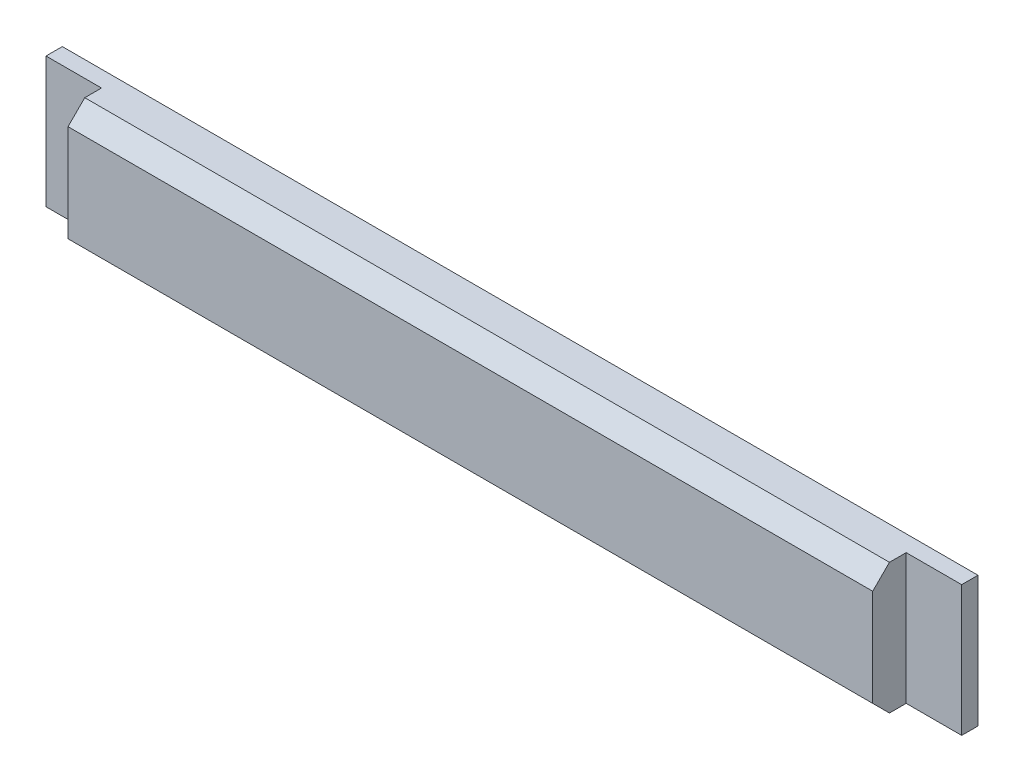
ISO-10303-21;
HEADER;
FILE_DESCRIPTION(('STEP AP214'),'2;1');
FILE_NAME('part.step','',(''),(''),'','','');
FILE_SCHEMA(('AUTOMOTIVE_DESIGN { 1 0 10303 214 1 1 1 1 }'));
ENDSEC;
DATA;
#1=APPLICATION_CONTEXT('core data for automotive mechanical design processes');
#2=APPLICATION_PROTOCOL_DEFINITION('international standard','automotive_design',2000,#1);
#3=PRODUCT_CONTEXT('',#1,'mechanical');
#4=PRODUCT('Part','Part','',(#3));
#5=PRODUCT_RELATED_PRODUCT_CATEGORY('part','',(#4));
#6=PRODUCT_DEFINITION_FORMATION('','',#4);
#7=PRODUCT_DEFINITION_CONTEXT('part definition',#1,'design');
#8=PRODUCT_DEFINITION('design','',#6,#7);
#9=PRODUCT_DEFINITION_SHAPE('','',#8);
#10=(LENGTH_UNIT() NAMED_UNIT(*) SI_UNIT(.MILLI.,.METRE.));
#11=(NAMED_UNIT(*) PLANE_ANGLE_UNIT() SI_UNIT($,.RADIAN.));
#12=(NAMED_UNIT(*) SI_UNIT($,.STERADIAN.) SOLID_ANGLE_UNIT());
#13=UNCERTAINTY_MEASURE_WITH_UNIT(LENGTH_MEASURE(1.E-05),#10,'distance_accuracy_value','');
#14=(GEOMETRIC_REPRESENTATION_CONTEXT(3) GLOBAL_UNCERTAINTY_ASSIGNED_CONTEXT((#13)) GLOBAL_UNIT_ASSIGNED_CONTEXT((#10,
#11,#12)) REPRESENTATION_CONTEXT('',''));
#15=CARTESIAN_POINT('',(0.,0.,0.));
#16=DIRECTION('',(0.,0.,1.));
#17=DIRECTION('',(1.,0.,0.));
#18=AXIS2_PLACEMENT_3D('',#15,#16,#17);
#19=CARTESIAN_POINT('',(0.,0.,5.));
#20=DIRECTION('',(0.,0.,1.));
#21=DIRECTION('',(1.,0.,0.));
#22=AXIS2_PLACEMENT_3D('',#19,#20,#21);
#23=PLANE('',#22);
#24=DIRECTION('',(0.,-1.,0.));
#25=VECTOR('',#24,1.);
#26=CARTESIAN_POINT('',(-121.085152838428,137.813864628821,5.));
#27=LINE('',#26,#25);
#28=CARTESIAN_POINT('',(-121.085152838428,137.813864628821,5.));
#29=VERTEX_POINT('',#28);
#30=CARTESIAN_POINT('',(-121.085152838428,97.8138646288209,5.));
#31=VERTEX_POINT('',#30);
#32=EDGE_CURVE('E139',#29,#31,#27,.T.);
#33=ORIENTED_EDGE('',*,*,#32,.F.);
#34=DIRECTION('',(-1.,0.,0.));
#35=VECTOR('',#34,1.);
#36=CARTESIAN_POINT('',(-138.085152838428,137.813864628821,5.));
#37=LINE('',#36,#35);
#38=CARTESIAN_POINT('',(-138.085152838428,137.813864628821,5.));
#39=VERTEX_POINT('',#38);
#40=EDGE_CURVE('E151',#29,#39,#37,.T.);
#41=ORIENTED_EDGE('',*,*,#40,.T.);
#42=DIRECTION('',(0.,-1.,0.));
#43=VECTOR('',#42,1.);
#44=CARTESIAN_POINT('',(-138.085152838428,97.8138646288209,5.));
#45=LINE('',#44,#43);
#46=CARTESIAN_POINT('',(-138.085152838428,97.8138646288209,5.));
#47=VERTEX_POINT('',#46);
#48=EDGE_CURVE('E167',#39,#47,#45,.T.);
#49=ORIENTED_EDGE('',*,*,#48,.T.);
#50=DIRECTION('',(1.,0.,0.));
#51=VECTOR('',#50,1.);
#52=CARTESIAN_POINT('',(-138.085152838428,97.8138646288209,5.));
#53=LINE('',#52,#51);
#54=EDGE_CURVE('E42',#47,#31,#53,.T.);
#55=ORIENTED_EDGE('',*,*,#54,.T.);
#56=EDGE_LOOP('',(#33,#41,#49,#55));
#57=FACE_BOUND('',#56,.T.);
#58=ADVANCED_FACE('F33',(#57),#23,.T.);
#59=CARTESIAN_POINT('',(-138.085152838428,97.8138646288209,288.337696044843));
#60=DIRECTION('',(1.,0.,0.));
#61=DIRECTION('',(0.,0.,-1.));
#62=AXIS2_PLACEMENT_3D('',#59,#60,#61);
#63=PLANE('',#62);
#64=ORIENTED_EDGE('',*,*,#48,.F.);
#65=DIRECTION('',(0.,0.,-1.));
#66=VECTOR('',#65,1.);
#67=CARTESIAN_POINT('',(-138.085152838428,137.813864628821,288.337696044843));
#68=LINE('',#67,#66);
#69=CARTESIAN_POINT('',(-138.085152838428,137.813864628821,0.));
#70=VERTEX_POINT('',#69);
#71=EDGE_CURVE('E37',#39,#70,#68,.T.);
#72=ORIENTED_EDGE('',*,*,#71,.T.);
#73=DIRECTION('',(0.,-1.,0.));
#74=VECTOR('',#73,1.);
#75=CARTESIAN_POINT('',(-138.085152838428,97.8138646288209,0.));
#76=LINE('',#75,#74);
#77=CARTESIAN_POINT('',(-138.085152838428,97.8138646288209,0.));
#78=VERTEX_POINT('',#77);
#79=EDGE_CURVE('E161',#70,#78,#76,.T.);
#80=ORIENTED_EDGE('',*,*,#79,.T.);
#81=DIRECTION('',(0.,0.,-1.));
#82=VECTOR('',#81,1.);
#83=CARTESIAN_POINT('',(-138.085152838428,97.8138646288209,288.337696044843));
#84=LINE('',#83,#82);
#85=EDGE_CURVE('E160',#47,#78,#84,.T.);
#86=ORIENTED_EDGE('',*,*,#85,.F.);
#87=EDGE_LOOP('',(#64,#72,#80,#86));
#88=FACE_BOUND('',#87,.T.);
#89=ADVANCED_FACE('F192',(#88),#63,.F.);
#90=CARTESIAN_POINT('',(-138.085152838428,97.8138646288209,288.337696044843));
#91=DIRECTION('',(0.,1.,0.));
#92=DIRECTION('',(0.,0.,1.));
#93=AXIS2_PLACEMENT_3D('',#90,#91,#92);
#94=PLANE('',#93);
#95=DIRECTION('',(0.,0.,-1.));
#96=VECTOR('',#95,1.);
#97=CARTESIAN_POINT('',(125.414847161572,97.8138646288209,15.25));
#98=LINE('',#97,#96);
#99=CARTESIAN_POINT('',(125.414847161572,97.8138646288208,10.125));
#100=VERTEX_POINT('',#99);
#101=CARTESIAN_POINT('',(125.414847161572,97.8138646288209,5.));
#102=VERTEX_POINT('',#101);
#103=EDGE_CURVE('E144',#100,#102,#98,.T.);
#104=ORIENTED_EDGE('',*,*,#103,.F.);
#105=DIRECTION('',(-1.,0.,0.));
#106=VECTOR('',#105,1.);
#107=CARTESIAN_POINT('',(142.415847161572,97.8138646288207,10.125));
#108=LINE('',#107,#106);
#109=CARTESIAN_POINT('',(-121.085152838428,97.8138646288209,10.125));
#110=VERTEX_POINT('',#109);
#111=EDGE_CURVE('E127',#100,#110,#108,.T.);
#112=ORIENTED_EDGE('',*,*,#111,.T.);
#113=DIRECTION('',(0.,0.,-1.));
#114=VECTOR('',#113,1.);
#115=CARTESIAN_POINT('',(-121.085152838428,97.8138646288209,15.25));
#116=LINE('',#115,#114);
#117=EDGE_CURVE('E146',#110,#31,#116,.T.);
#118=ORIENTED_EDGE('',*,*,#117,.T.);
#119=ORIENTED_EDGE('',*,*,#54,.F.);
#120=ORIENTED_EDGE('',*,*,#85,.T.);
#121=DIRECTION('',(1.,0.,0.));
#122=VECTOR('',#121,1.);
#123=CARTESIAN_POINT('',(-138.085152838428,97.8138646288209,0.));
#124=LINE('',#123,#122);
#125=CARTESIAN_POINT('',(142.414847161572,97.8138646288209,0.));
#126=VERTEX_POINT('',#125);
#127=EDGE_CURVE('E157',#78,#126,#124,.T.);
#128=ORIENTED_EDGE('',*,*,#127,.T.);
#129=DIRECTION('',(0.,0.,-1.));
#130=VECTOR('',#129,1.);
#131=CARTESIAN_POINT('',(142.414847161572,97.8138646288209,288.337696044843));
#132=LINE('',#131,#130);
#133=CARTESIAN_POINT('',(142.414847161572,97.8138646288209,5.));
#134=VERTEX_POINT('',#133);
#135=EDGE_CURVE('E156',#134,#126,#132,.T.);
#136=ORIENTED_EDGE('',*,*,#135,.F.);
#137=EDGE_CURVE('E166',#102,#134,#53,.T.);
#138=ORIENTED_EDGE('',*,*,#137,.F.);
#139=EDGE_LOOP('',(#104,#112,#118,#119,#120,#128,#136,#138));
#140=FACE_BOUND('',#139,.T.);
#141=ADVANCED_FACE('F210',(#140),#94,.F.);
#142=CARTESIAN_POINT('',(142.414847161572,97.8138646288209,288.337696044843));
#143=DIRECTION('',(-1.,0.,0.));
#144=DIRECTION('',(0.,0.,1.));
#145=AXIS2_PLACEMENT_3D('',#142,#143,#144);
#146=PLANE('',#145);
#147=DIRECTION('',(0.,1.,0.));
#148=VECTOR('',#147,1.);
#149=CARTESIAN_POINT('',(142.414847161572,97.8138646288209,5.));
#150=LINE('',#149,#148);
#151=CARTESIAN_POINT('',(142.414847161572,137.813864628821,5.));
#152=VERTEX_POINT('',#151);
#153=EDGE_CURVE('E11',#134,#152,#150,.T.);
#154=ORIENTED_EDGE('',*,*,#153,.F.);
#155=ORIENTED_EDGE('',*,*,#135,.T.);
#156=DIRECTION('',(0.,1.,0.));
#157=VECTOR('',#156,1.);
#158=CARTESIAN_POINT('',(142.414847161572,97.8138646288209,0.));
#159=LINE('',#158,#157);
#160=CARTESIAN_POINT('',(142.414847161572,137.813864628821,0.));
#161=VERTEX_POINT('',#160);
#162=EDGE_CURVE('E153',#126,#161,#159,.T.);
#163=ORIENTED_EDGE('',*,*,#162,.T.);
#164=DIRECTION('',(0.,0.,-1.));
#165=VECTOR('',#164,1.);
#166=CARTESIAN_POINT('',(142.414847161572,137.813864628821,288.337696044843));
#167=LINE('',#166,#165);
#168=EDGE_CURVE('E152',#152,#161,#167,.T.);
#169=ORIENTED_EDGE('',*,*,#168,.F.);
#170=EDGE_LOOP('',(#154,#155,#163,#169));
#171=FACE_BOUND('',#170,.T.);
#172=ADVANCED_FACE('F184',(#171),#146,.F.);
#173=CARTESIAN_POINT('',(-138.085152838428,137.813864628821,288.337696044843));
#174=DIRECTION('',(0.,-1.,0.));
#175=DIRECTION('',(0.,0.,-1.));
#176=AXIS2_PLACEMENT_3D('',#173,#174,#175);
#177=PLANE('',#176);
#178=DIRECTION('',(0.,0.,-1.));
#179=VECTOR('',#178,1.);
#180=CARTESIAN_POINT('',(-121.085152838428,137.813864628821,15.25));
#181=LINE('',#180,#179);
#182=CARTESIAN_POINT('',(-121.085152838428,137.813864628821,10.125));
#183=VERTEX_POINT('',#182);
#184=EDGE_CURVE('E131',#183,#29,#181,.T.);
#185=ORIENTED_EDGE('',*,*,#184,.F.);
#186=DIRECTION('',(-1.,0.,0.));
#187=VECTOR('',#186,1.);
#188=CARTESIAN_POINT('',(142.415847161572,137.813864628821,10.125));
#189=LINE('',#188,#187);
#190=CARTESIAN_POINT('',(125.414847161572,137.813864628821,10.125));
#191=VERTEX_POINT('',#190);
#192=EDGE_CURVE('E118',#191,#183,#189,.T.);
#193=ORIENTED_EDGE('',*,*,#192,.F.);
#194=DIRECTION('',(0.,0.,-1.));
#195=VECTOR('',#194,1.);
#196=CARTESIAN_POINT('',(125.414847161572,137.813864628821,15.25));
#197=LINE('',#196,#195);
#198=CARTESIAN_POINT('',(125.414847161572,137.813864628821,5.));
#199=VERTEX_POINT('',#198);
#200=EDGE_CURVE('E126',#191,#199,#197,.T.);
#201=ORIENTED_EDGE('',*,*,#200,.T.);
#202=EDGE_CURVE('E170',#152,#199,#37,.T.);
#203=ORIENTED_EDGE('',*,*,#202,.F.);
#204=ORIENTED_EDGE('',*,*,#168,.T.);
#205=DIRECTION('',(-1.,0.,0.));
#206=VECTOR('',#205,1.);
#207=CARTESIAN_POINT('',(-138.085152838428,137.813864628821,0.));
#208=LINE('',#207,#206);
#209=EDGE_CURVE('E148',#161,#70,#208,.T.);
#210=ORIENTED_EDGE('',*,*,#209,.T.);
#211=ORIENTED_EDGE('',*,*,#71,.F.);
#212=ORIENTED_EDGE('',*,*,#40,.F.);
#213=EDGE_LOOP('',(#185,#193,#201,#203,#204,#210,#211,#212));
#214=FACE_BOUND('',#213,.T.);
#215=ADVANCED_FACE('F177',(#214),#177,.F.);
#216=CARTESIAN_POINT('',(0.,0.,0.));
#217=DIRECTION('',(0.,0.,-1.));
#218=DIRECTION('',(-1.,0.,0.));
#219=AXIS2_PLACEMENT_3D('',#216,#217,#218);
#220=PLANE('',#219);
#221=ORIENTED_EDGE('',*,*,#79,.F.);
#222=ORIENTED_EDGE('',*,*,#209,.F.);
#223=ORIENTED_EDGE('',*,*,#162,.F.);
#224=ORIENTED_EDGE('',*,*,#127,.F.);
#225=EDGE_LOOP('',(#221,#222,#223,#224));
#226=FACE_BOUND('',#225,.T.);
#227=ADVANCED_FACE('F188',(#226),#220,.T.);
#228=DIRECTION('',(0.,1.,0.));
#229=VECTOR('',#228,1.);
#230=CARTESIAN_POINT('',(125.414847161572,137.813864628821,5.));
#231=LINE('',#230,#229);
#232=EDGE_CURVE('E135',#102,#199,#231,.T.);
#233=ORIENTED_EDGE('',*,*,#232,.F.);
#234=ORIENTED_EDGE('',*,*,#137,.T.);
#235=ORIENTED_EDGE('',*,*,#153,.T.);
#236=ORIENTED_EDGE('',*,*,#202,.T.);
#237=EDGE_LOOP('',(#233,#234,#235,#236));
#238=FACE_BOUND('',#237,.T.);
#239=ADVANCED_FACE('F35',(#238),#23,.T.);
#240=CARTESIAN_POINT('',(-121.085152838428,137.813864628821,15.25));
#241=DIRECTION('',(1.,0.,0.));
#242=DIRECTION('',(0.,1.,0.));
#243=AXIS2_PLACEMENT_3D('',#240,#241,#242);
#244=PLANE('',#243);
#245=DIRECTION('',(0.,-1.,0.));
#246=VECTOR('',#245,1.);
#247=CARTESIAN_POINT('',(-121.085152838428,137.813864628821,15.25));
#248=LINE('',#247,#246);
#249=CARTESIAN_POINT('',(-121.085152838428,132.688864628821,15.25));
#250=VERTEX_POINT('',#249);
#251=CARTESIAN_POINT('',(-121.085152838428,102.938864628821,15.25));
#252=VERTEX_POINT('',#251);
#253=EDGE_CURVE('E132',#250,#252,#248,.T.);
#254=ORIENTED_EDGE('',*,*,#253,.F.);
#255=DIRECTION('',(0.,-0.707106781186547,0.707106781186548));
#256=VECTOR('',#255,1.);
#257=CARTESIAN_POINT('',(-121.085152838428,132.688864628821,15.25));
#258=LINE('',#257,#256);
#259=EDGE_CURVE('E58',#183,#250,#258,.T.);
#260=ORIENTED_EDGE('',*,*,#259,.F.);
#261=ORIENTED_EDGE('',*,*,#184,.T.);
#262=ORIENTED_EDGE('',*,*,#32,.T.);
#263=ORIENTED_EDGE('',*,*,#117,.F.);
#264=DIRECTION('',(0.,-0.707106781186547,-0.707106781186548));
#265=VECTOR('',#264,1.);
#266=CARTESIAN_POINT('',(-121.085152838428,102.938864628821,15.25));
#267=LINE('',#266,#265);
#268=EDGE_CURVE('E204',#252,#110,#267,.T.);
#269=ORIENTED_EDGE('',*,*,#268,.F.);
#270=EDGE_LOOP('',(#254,#260,#261,#262,#263,#269));
#271=FACE_BOUND('',#270,.T.);
#272=ADVANCED_FACE('F198',(#271),#244,.F.);
#273=CARTESIAN_POINT('',(125.414847161572,137.813864628821,15.25));
#274=DIRECTION('',(-1.,0.,0.));
#275=DIRECTION('',(0.,-1.,0.));
#276=AXIS2_PLACEMENT_3D('',#273,#274,#275);
#277=PLANE('',#276);
#278=ORIENTED_EDGE('',*,*,#200,.F.);
#279=DIRECTION('',(0.,0.707106781186547,-0.707106781186548));
#280=VECTOR('',#279,1.);
#281=CARTESIAN_POINT('',(125.414847161572,132.688864628821,15.25));
#282=LINE('',#281,#280);
#283=CARTESIAN_POINT('',(125.414847161572,132.688864628821,15.25));
#284=VERTEX_POINT('',#283);
#285=EDGE_CURVE('E112',#284,#191,#282,.T.);
#286=ORIENTED_EDGE('',*,*,#285,.F.);
#287=DIRECTION('',(0.,1.,0.));
#288=VECTOR('',#287,1.);
#289=CARTESIAN_POINT('',(125.414847161572,137.813864628821,15.25));
#290=LINE('',#289,#288);
#291=CARTESIAN_POINT('',(125.414847161572,102.938864628821,15.25));
#292=VERTEX_POINT('',#291);
#293=EDGE_CURVE('E124',#292,#284,#290,.T.);
#294=ORIENTED_EDGE('',*,*,#293,.F.);
#295=DIRECTION('',(0.,0.707106781186547,0.707106781186548));
#296=VECTOR('',#295,1.);
#297=CARTESIAN_POINT('',(125.414847161572,102.938864628821,15.25));
#298=LINE('',#297,#296);
#299=EDGE_CURVE('E50',#100,#292,#298,.T.);
#300=ORIENTED_EDGE('',*,*,#299,.F.);
#301=ORIENTED_EDGE('',*,*,#103,.T.);
#302=ORIENTED_EDGE('',*,*,#232,.T.);
#303=EDGE_LOOP('',(#278,#286,#294,#300,#301,#302));
#304=FACE_BOUND('',#303,.T.);
#305=ADVANCED_FACE('F123',(#304),#277,.F.);
#306=CARTESIAN_POINT('',(0.,0.,15.25));
#307=DIRECTION('',(0.,0.,1.));
#308=DIRECTION('',(1.,0.,0.));
#309=AXIS2_PLACEMENT_3D('',#306,#307,#308);
#310=PLANE('',#309);
#311=DIRECTION('',(-1.,0.,0.));
#312=VECTOR('',#311,1.);
#313=CARTESIAN_POINT('',(142.415847161572,132.688864628821,15.25));
#314=LINE('',#313,#312);
#315=EDGE_CURVE('E109',#284,#250,#314,.T.);
#316=ORIENTED_EDGE('',*,*,#315,.T.);
#317=ORIENTED_EDGE('',*,*,#253,.T.);
#318=DIRECTION('',(-1.,0.,0.));
#319=VECTOR('',#318,1.);
#320=CARTESIAN_POINT('',(142.415847161572,102.938864628821,15.25));
#321=LINE('',#320,#319);
#322=EDGE_CURVE('E130',#292,#252,#321,.T.);
#323=ORIENTED_EDGE('',*,*,#322,.F.);
#324=ORIENTED_EDGE('',*,*,#293,.T.);
#325=EDGE_LOOP('',(#316,#317,#323,#324));
#326=FACE_BOUND('',#325,.T.);
#327=ADVANCED_FACE('F129',(#326),#310,.T.);
#328=CARTESIAN_POINT('',(142.415847161572,102.938864628821,15.25));
#329=DIRECTION('',(0.,0.707106781186548,-0.707106781186547));
#330=DIRECTION('',(0.,0.707106781186547,0.707106781186548));
#331=AXIS2_PLACEMENT_3D('',#328,#329,#330);
#332=PLANE('',#331);
#333=ORIENTED_EDGE('',*,*,#299,.T.);
#334=ORIENTED_EDGE('',*,*,#322,.T.);
#335=ORIENTED_EDGE('',*,*,#268,.T.);
#336=ORIENTED_EDGE('',*,*,#111,.F.);
#337=EDGE_LOOP('',(#333,#334,#335,#336));
#338=FACE_BOUND('',#337,.T.);
#339=ADVANCED_FACE('F207',(#338),#332,.F.);
#340=CARTESIAN_POINT('',(142.415847161572,132.688864628821,15.25));
#341=DIRECTION('',(0.,-0.707106781186548,-0.707106781186547));
#342=DIRECTION('',(0.,0.707106781186547,-0.707106781186548));
#343=AXIS2_PLACEMENT_3D('',#340,#341,#342);
#344=PLANE('',#343);
#345=ORIENTED_EDGE('',*,*,#285,.T.);
#346=ORIENTED_EDGE('',*,*,#192,.T.);
#347=ORIENTED_EDGE('',*,*,#259,.T.);
#348=ORIENTED_EDGE('',*,*,#315,.F.);
#349=EDGE_LOOP('',(#345,#346,#347,#348));
#350=FACE_BOUND('',#349,.T.);
#351=ADVANCED_FACE('F111',(#350),#344,.F.);
#352=CLOSED_SHELL('',(#58,#89,#141,#172,#215,#227,#239,#272,#305,#327,#339,#351));
#353=MANIFOLD_SOLID_BREP('B2',#352);
#354=ADVANCED_BREP_SHAPE_REPRESENTATION('',(#18,#353),#14);
#355=SHAPE_DEFINITION_REPRESENTATION(#9,#354);
ENDSEC;
END-ISO-10303-21;
